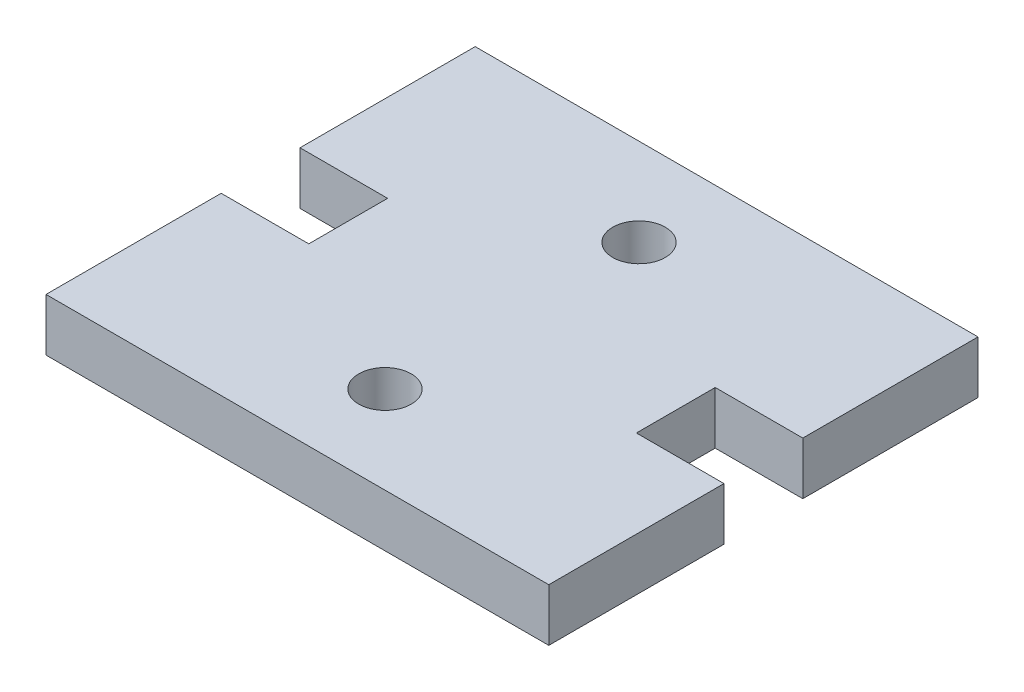
ISO-10303-21;
HEADER;
FILE_DESCRIPTION(('STEP AP214'),'2;1');
FILE_NAME('part.step','',(''),(''),'','','');
FILE_SCHEMA(('AUTOMOTIVE_DESIGN { 1 0 10303 214 1 1 1 1 }'));
ENDSEC;
DATA;
#1=APPLICATION_CONTEXT('core data for automotive mechanical design processes');
#2=APPLICATION_PROTOCOL_DEFINITION('international standard','automotive_design',2000,#1);
#3=PRODUCT_CONTEXT('',#1,'mechanical');
#4=PRODUCT('Part','Part','',(#3));
#5=PRODUCT_RELATED_PRODUCT_CATEGORY('part','',(#4));
#6=PRODUCT_DEFINITION_FORMATION('','',#4);
#7=PRODUCT_DEFINITION_CONTEXT('part definition',#1,'design');
#8=PRODUCT_DEFINITION('design','',#6,#7);
#9=PRODUCT_DEFINITION_SHAPE('','',#8);
#10=(LENGTH_UNIT() NAMED_UNIT(*) SI_UNIT(.MILLI.,.METRE.));
#11=(NAMED_UNIT(*) PLANE_ANGLE_UNIT() SI_UNIT($,.RADIAN.));
#12=(NAMED_UNIT(*) SI_UNIT($,.STERADIAN.) SOLID_ANGLE_UNIT());
#13=UNCERTAINTY_MEASURE_WITH_UNIT(LENGTH_MEASURE(1.E-05),#10,'distance_accuracy_value','');
#14=(GEOMETRIC_REPRESENTATION_CONTEXT(3) GLOBAL_UNCERTAINTY_ASSIGNED_CONTEXT((#13)) GLOBAL_UNIT_ASSIGNED_CONTEXT((#10,
#11,#12)) REPRESENTATION_CONTEXT('',''));
#15=CARTESIAN_POINT('',(0.,0.,0.));
#16=DIRECTION('',(0.,0.,1.));
#17=DIRECTION('',(1.,0.,0.));
#18=AXIS2_PLACEMENT_3D('',#15,#16,#17);
#19=CARTESIAN_POINT('',(0.,3.,0.));
#20=DIRECTION('',(0.,-1.,0.));
#21=DIRECTION('',(0.,0.,-1.));
#22=AXIS2_PLACEMENT_3D('',#19,#20,#21);
#23=PLANE('',#22);
#24=DIRECTION('',(1.,0.,0.));
#25=VECTOR('',#24,1.);
#26=CARTESIAN_POINT('',(-9.35000000000002,3.,-2.25000000000003));
#27=LINE('',#26,#25);
#28=CARTESIAN_POINT('',(-14.35,3.,-2.25000000000003));
#29=VERTEX_POINT('',#28);
#30=CARTESIAN_POINT('',(-9.35000000000002,3.,-2.25000000000003));
#31=VERTEX_POINT('',#30);
#32=EDGE_CURVE('E182',#29,#31,#27,.T.);
#33=ORIENTED_EDGE('',*,*,#32,.T.);
#34=DIRECTION('',(0.,0.,1.));
#35=VECTOR('',#34,1.);
#36=CARTESIAN_POINT('',(-9.35000000000002,3.,2.25));
#37=LINE('',#36,#35);
#38=CARTESIAN_POINT('',(-9.35000000000002,3.,2.25));
#39=VERTEX_POINT('',#38);
#40=EDGE_CURVE('E110',#31,#39,#37,.T.);
#41=ORIENTED_EDGE('',*,*,#40,.T.);
#42=DIRECTION('',(-1.,0.,0.));
#43=VECTOR('',#42,1.);
#44=CARTESIAN_POINT('',(-14.35,3.,2.25));
#45=LINE('',#44,#43);
#46=CARTESIAN_POINT('',(-14.35,3.,2.25));
#47=VERTEX_POINT('',#46);
#48=EDGE_CURVE('E209',#39,#47,#45,.T.);
#49=ORIENTED_EDGE('',*,*,#48,.T.);
#50=DIRECTION('',(0.,0.,1.));
#51=VECTOR('',#50,1.);
#52=CARTESIAN_POINT('',(-14.35,3.,12.25));
#53=LINE('',#52,#51);
#54=CARTESIAN_POINT('',(-14.35,3.,12.25));
#55=VERTEX_POINT('',#54);
#56=EDGE_CURVE('E228',#47,#55,#53,.T.);
#57=ORIENTED_EDGE('',*,*,#56,.T.);
#58=DIRECTION('',(1.,0.,0.));
#59=VECTOR('',#58,1.);
#60=CARTESIAN_POINT('',(14.35,3.,12.25));
#61=LINE('',#60,#59);
#62=CARTESIAN_POINT('',(14.35,3.,12.25));
#63=VERTEX_POINT('',#62);
#64=EDGE_CURVE('E225',#55,#63,#61,.T.);
#65=ORIENTED_EDGE('',*,*,#64,.T.);
#66=DIRECTION('',(0.,0.,-1.));
#67=VECTOR('',#66,1.);
#68=CARTESIAN_POINT('',(14.35,3.,2.25));
#69=LINE('',#68,#67);
#70=CARTESIAN_POINT('',(14.35,3.,2.25));
#71=VERTEX_POINT('',#70);
#72=EDGE_CURVE('E227',#63,#71,#69,.T.);
#73=ORIENTED_EDGE('',*,*,#72,.T.);
#74=DIRECTION('',(-1.,0.,0.));
#75=VECTOR('',#74,1.);
#76=CARTESIAN_POINT('',(9.34999999999997,3.,2.25));
#77=LINE('',#76,#75);
#78=CARTESIAN_POINT('',(9.34999999999997,3.,2.25));
#79=VERTEX_POINT('',#78);
#80=EDGE_CURVE('E230',#71,#79,#77,.T.);
#81=ORIENTED_EDGE('',*,*,#80,.T.);
#82=DIRECTION('',(0.,0.,-1.));
#83=VECTOR('',#82,1.);
#84=CARTESIAN_POINT('',(9.34999999999997,3.,-2.25000000000003));
#85=LINE('',#84,#83);
#86=CARTESIAN_POINT('',(9.34999999999997,3.,-2.25000000000003));
#87=VERTEX_POINT('',#86);
#88=EDGE_CURVE('E236',#79,#87,#85,.T.);
#89=ORIENTED_EDGE('',*,*,#88,.T.);
#90=DIRECTION('',(1.,0.,0.));
#91=VECTOR('',#90,1.);
#92=CARTESIAN_POINT('',(14.35,3.,-2.25000000000003));
#93=LINE('',#92,#91);
#94=CARTESIAN_POINT('',(14.35,3.,-2.25000000000003));
#95=VERTEX_POINT('',#94);
#96=EDGE_CURVE('E141',#87,#95,#93,.T.);
#97=ORIENTED_EDGE('',*,*,#96,.T.);
#98=DIRECTION('',(0.,0.,-1.));
#99=VECTOR('',#98,1.);
#100=CARTESIAN_POINT('',(14.35,3.,-12.25));
#101=LINE('',#100,#99);
#102=CARTESIAN_POINT('',(14.35,3.,-12.25));
#103=VERTEX_POINT('',#102);
#104=EDGE_CURVE('E135',#95,#103,#101,.T.);
#105=ORIENTED_EDGE('',*,*,#104,.T.);
#106=DIRECTION('',(-1.,0.,0.));
#107=VECTOR('',#106,1.);
#108=CARTESIAN_POINT('',(-14.35,3.,-12.25));
#109=LINE('',#108,#107);
#110=CARTESIAN_POINT('',(-14.35,3.,-12.25));
#111=VERTEX_POINT('',#110);
#112=EDGE_CURVE('E139',#103,#111,#109,.T.);
#113=ORIENTED_EDGE('',*,*,#112,.T.);
#114=DIRECTION('',(0.,0.,1.));
#115=VECTOR('',#114,1.);
#116=CARTESIAN_POINT('',(-14.35,3.,-2.25000000000003));
#117=LINE('',#116,#115);
#118=EDGE_CURVE('E55',#111,#29,#117,.T.);
#119=ORIENTED_EDGE('',*,*,#118,.T.);
#120=EDGE_LOOP('',(#33,#41,#49,#57,#65,#73,#81,#89,#97,#105,#113,#119));
#121=FACE_BOUND('',#120,.T.);
#122=CARTESIAN_POINT('',(0.,3.,-7.25000000000003));
#123=DIRECTION('',(0.,1.,0.));
#124=DIRECTION('',(0.,0.,1.));
#125=AXIS2_PLACEMENT_3D('',#122,#123,#124);
#126=CIRCLE('',#125,1.5);
#127=CARTESIAN_POINT('',(0.,3.,-5.75000000000003));
#128=VERTEX_POINT('',#127);
#129=EDGE_CURVE('E163',#128,#128,#126,.T.);
#130=ORIENTED_EDGE('',*,*,#129,.F.);
#131=EDGE_LOOP('',(#130));
#132=FACE_BOUND('',#131,.T.);
#133=CARTESIAN_POINT('',(0.,3.,7.25000000000001));
#134=DIRECTION('',(0.,1.,0.));
#135=DIRECTION('',(0.,0.,1.));
#136=AXIS2_PLACEMENT_3D('',#133,#134,#135);
#137=CIRCLE('',#136,1.5);
#138=CARTESIAN_POINT('',(0.,3.,8.75000000000001));
#139=VERTEX_POINT('',#138);
#140=EDGE_CURVE('E277',#139,#139,#137,.T.);
#141=ORIENTED_EDGE('',*,*,#140,.F.);
#142=EDGE_LOOP('',(#141));
#143=FACE_BOUND('',#142,.T.);
#144=ADVANCED_FACE('F38',(#121,#132,#143),#23,.F.);
#145=CARTESIAN_POINT('',(0.,0.,0.));
#146=DIRECTION('',(0.,-1.,0.));
#147=DIRECTION('',(0.,0.,-1.));
#148=AXIS2_PLACEMENT_3D('',#145,#146,#147);
#149=PLANE('',#148);
#150=CARTESIAN_POINT('',(0.,0.,-7.25000000000003));
#151=DIRECTION('',(0.,1.,0.));
#152=DIRECTION('',(0.,0.,1.));
#153=AXIS2_PLACEMENT_3D('',#150,#151,#152);
#154=CIRCLE('',#153,1.5);
#155=CARTESIAN_POINT('',(0.,0.,-5.75000000000003));
#156=VERTEX_POINT('',#155);
#157=EDGE_CURVE('E282',#156,#156,#154,.T.);
#158=ORIENTED_EDGE('',*,*,#157,.T.);
#159=EDGE_LOOP('',(#158));
#160=FACE_BOUND('',#159,.T.);
#161=DIRECTION('',(1.,0.,0.));
#162=VECTOR('',#161,1.);
#163=CARTESIAN_POINT('',(-9.35000000000002,0.,-2.25000000000003));
#164=LINE('',#163,#162);
#165=CARTESIAN_POINT('',(-14.35,0.,-2.25000000000003));
#166=VERTEX_POINT('',#165);
#167=CARTESIAN_POINT('',(-9.35000000000002,0.,-2.25000000000003));
#168=VERTEX_POINT('',#167);
#169=EDGE_CURVE('E159',#166,#168,#164,.T.);
#170=ORIENTED_EDGE('',*,*,#169,.F.);
#171=DIRECTION('',(0.,0.,1.));
#172=VECTOR('',#171,1.);
#173=CARTESIAN_POINT('',(-14.35,0.,-2.25000000000003));
#174=LINE('',#173,#172);
#175=CARTESIAN_POINT('',(-14.35,0.,-12.25));
#176=VERTEX_POINT('',#175);
#177=EDGE_CURVE('E102',#176,#166,#174,.T.);
#178=ORIENTED_EDGE('',*,*,#177,.F.);
#179=DIRECTION('',(-1.,0.,0.));
#180=VECTOR('',#179,1.);
#181=CARTESIAN_POINT('',(-14.35,0.,-12.25));
#182=LINE('',#181,#180);
#183=CARTESIAN_POINT('',(14.35,0.,-12.25));
#184=VERTEX_POINT('',#183);
#185=EDGE_CURVE('E96',#184,#176,#182,.T.);
#186=ORIENTED_EDGE('',*,*,#185,.F.);
#187=DIRECTION('',(0.,0.,-1.));
#188=VECTOR('',#187,1.);
#189=CARTESIAN_POINT('',(14.35,0.,-12.25));
#190=LINE('',#189,#188);
#191=CARTESIAN_POINT('',(14.35,0.,-2.25000000000003));
#192=VERTEX_POINT('',#191);
#193=EDGE_CURVE('E149',#192,#184,#190,.T.);
#194=ORIENTED_EDGE('',*,*,#193,.F.);
#195=DIRECTION('',(1.,0.,0.));
#196=VECTOR('',#195,1.);
#197=CARTESIAN_POINT('',(14.35,0.,-2.25000000000003));
#198=LINE('',#197,#196);
#199=CARTESIAN_POINT('',(9.34999999999997,0.,-2.25000000000003));
#200=VERTEX_POINT('',#199);
#201=EDGE_CURVE('E177',#200,#192,#198,.T.);
#202=ORIENTED_EDGE('',*,*,#201,.F.);
#203=DIRECTION('',(0.,0.,-1.));
#204=VECTOR('',#203,1.);
#205=CARTESIAN_POINT('',(9.34999999999997,0.,-2.25000000000003));
#206=LINE('',#205,#204);
#207=CARTESIAN_POINT('',(9.34999999999997,0.,2.25));
#208=VERTEX_POINT('',#207);
#209=EDGE_CURVE('E175',#208,#200,#206,.T.);
#210=ORIENTED_EDGE('',*,*,#209,.F.);
#211=DIRECTION('',(-1.,0.,0.));
#212=VECTOR('',#211,1.);
#213=CARTESIAN_POINT('',(9.34999999999997,0.,2.25));
#214=LINE('',#213,#212);
#215=CARTESIAN_POINT('',(14.35,0.,2.25));
#216=VERTEX_POINT('',#215);
#217=EDGE_CURVE('E173',#216,#208,#214,.T.);
#218=ORIENTED_EDGE('',*,*,#217,.F.);
#219=DIRECTION('',(0.,0.,-1.));
#220=VECTOR('',#219,1.);
#221=CARTESIAN_POINT('',(14.35,0.,2.25));
#222=LINE('',#221,#220);
#223=CARTESIAN_POINT('',(14.35,0.,12.25));
#224=VERTEX_POINT('',#223);
#225=EDGE_CURVE('E171',#224,#216,#222,.T.);
#226=ORIENTED_EDGE('',*,*,#225,.F.);
#227=DIRECTION('',(1.,0.,0.));
#228=VECTOR('',#227,1.);
#229=CARTESIAN_POINT('',(14.35,0.,12.25));
#230=LINE('',#229,#228);
#231=CARTESIAN_POINT('',(-14.35,0.,12.25));
#232=VERTEX_POINT('',#231);
#233=EDGE_CURVE('E169',#232,#224,#230,.T.);
#234=ORIENTED_EDGE('',*,*,#233,.F.);
#235=DIRECTION('',(0.,0.,1.));
#236=VECTOR('',#235,1.);
#237=CARTESIAN_POINT('',(-14.35,0.,12.25));
#238=LINE('',#237,#236);
#239=CARTESIAN_POINT('',(-14.35,0.,2.25));
#240=VERTEX_POINT('',#239);
#241=EDGE_CURVE('E167',#240,#232,#238,.T.);
#242=ORIENTED_EDGE('',*,*,#241,.F.);
#243=DIRECTION('',(-1.,0.,0.));
#244=VECTOR('',#243,1.);
#245=CARTESIAN_POINT('',(-14.35,0.,2.25));
#246=LINE('',#245,#244);
#247=CARTESIAN_POINT('',(-9.35000000000002,0.,2.25));
#248=VERTEX_POINT('',#247);
#249=EDGE_CURVE('E165',#248,#240,#246,.T.);
#250=ORIENTED_EDGE('',*,*,#249,.F.);
#251=DIRECTION('',(0.,0.,1.));
#252=VECTOR('',#251,1.);
#253=CARTESIAN_POINT('',(-9.35000000000002,0.,2.25));
#254=LINE('',#253,#252);
#255=EDGE_CURVE('E162',#168,#248,#254,.T.);
#256=ORIENTED_EDGE('',*,*,#255,.F.);
#257=EDGE_LOOP('',(#170,#178,#186,#194,#202,#210,#218,#226,#234,#242,#250,#256));
#258=FACE_BOUND('',#257,.T.);
#259=CARTESIAN_POINT('',(0.,0.,7.25000000000001));
#260=DIRECTION('',(0.,1.,0.));
#261=DIRECTION('',(0.,0.,1.));
#262=AXIS2_PLACEMENT_3D('',#259,#260,#261);
#263=CIRCLE('',#262,1.5);
#264=CARTESIAN_POINT('',(0.,0.,8.75000000000001));
#265=VERTEX_POINT('',#264);
#266=EDGE_CURVE('E280',#265,#265,#263,.T.);
#267=ORIENTED_EDGE('',*,*,#266,.T.);
#268=EDGE_LOOP('',(#267));
#269=FACE_BOUND('',#268,.T.);
#270=ADVANCED_FACE('F213',(#160,#258,#269),#149,.T.);
#271=CARTESIAN_POINT('',(-9.35000000000002,3.,-2.25000000000003));
#272=DIRECTION('',(0.,0.,-1.));
#273=DIRECTION('',(-1.,0.,0.));
#274=AXIS2_PLACEMENT_3D('',#271,#272,#273);
#275=PLANE('',#274);
#276=ORIENTED_EDGE('',*,*,#169,.T.);
#277=DIRECTION('',(0.,-1.,0.));
#278=VECTOR('',#277,1.);
#279=CARTESIAN_POINT('',(-9.35000000000002,3.,-2.25000000000003));
#280=LINE('',#279,#278);
#281=EDGE_CURVE('E11',#31,#168,#280,.T.);
#282=ORIENTED_EDGE('',*,*,#281,.F.);
#283=ORIENTED_EDGE('',*,*,#32,.F.);
#284=DIRECTION('',(0.,-1.,0.));
#285=VECTOR('',#284,1.);
#286=CARTESIAN_POINT('',(-14.35,3.,-2.25000000000003));
#287=LINE('',#286,#285);
#288=EDGE_CURVE('E155',#29,#166,#287,.T.);
#289=ORIENTED_EDGE('',*,*,#288,.T.);
#290=EDGE_LOOP('',(#276,#282,#283,#289));
#291=FACE_BOUND('',#290,.T.);
#292=ADVANCED_FACE('F40',(#291),#275,.F.);
#293=CARTESIAN_POINT('',(-9.35000000000002,3.,2.25));
#294=DIRECTION('',(1.,0.,0.));
#295=DIRECTION('',(0.,0.,-1.));
#296=AXIS2_PLACEMENT_3D('',#293,#294,#295);
#297=PLANE('',#296);
#298=ORIENTED_EDGE('',*,*,#255,.T.);
#299=DIRECTION('',(0.,-1.,0.));
#300=VECTOR('',#299,1.);
#301=CARTESIAN_POINT('',(-9.35000000000002,3.,2.25));
#302=LINE('',#301,#300);
#303=EDGE_CURVE('E47',#39,#248,#302,.T.);
#304=ORIENTED_EDGE('',*,*,#303,.F.);
#305=ORIENTED_EDGE('',*,*,#40,.F.);
#306=ORIENTED_EDGE('',*,*,#281,.T.);
#307=EDGE_LOOP('',(#298,#304,#305,#306));
#308=FACE_BOUND('',#307,.T.);
#309=ADVANCED_FACE('F387',(#308),#297,.F.);
#310=CARTESIAN_POINT('',(-14.35,3.,2.25));
#311=DIRECTION('',(0.,0.,1.));
#312=DIRECTION('',(1.,0.,0.));
#313=AXIS2_PLACEMENT_3D('',#310,#311,#312);
#314=PLANE('',#313);
#315=ORIENTED_EDGE('',*,*,#249,.T.);
#316=DIRECTION('',(0.,-1.,0.));
#317=VECTOR('',#316,1.);
#318=CARTESIAN_POINT('',(-14.35,3.,2.25));
#319=LINE('',#318,#317);
#320=EDGE_CURVE('E201',#47,#240,#319,.T.);
#321=ORIENTED_EDGE('',*,*,#320,.F.);
#322=ORIENTED_EDGE('',*,*,#48,.F.);
#323=ORIENTED_EDGE('',*,*,#303,.T.);
#324=EDGE_LOOP('',(#315,#321,#322,#323));
#325=FACE_BOUND('',#324,.T.);
#326=ADVANCED_FACE('F207',(#325),#314,.F.);
#327=CARTESIAN_POINT('',(-14.35,3.,12.25));
#328=DIRECTION('',(1.,0.,0.));
#329=DIRECTION('',(0.,0.,-1.));
#330=AXIS2_PLACEMENT_3D('',#327,#328,#329);
#331=PLANE('',#330);
#332=ORIENTED_EDGE('',*,*,#241,.T.);
#333=DIRECTION('',(0.,-1.,0.));
#334=VECTOR('',#333,1.);
#335=CARTESIAN_POINT('',(-14.35,3.,12.25));
#336=LINE('',#335,#334);
#337=EDGE_CURVE('E198',#55,#232,#336,.T.);
#338=ORIENTED_EDGE('',*,*,#337,.F.);
#339=ORIENTED_EDGE('',*,*,#56,.F.);
#340=ORIENTED_EDGE('',*,*,#320,.T.);
#341=EDGE_LOOP('',(#332,#338,#339,#340));
#342=FACE_BOUND('',#341,.T.);
#343=ADVANCED_FACE('F219',(#342),#331,.F.);
#344=CARTESIAN_POINT('',(14.35,3.,12.25));
#345=DIRECTION('',(0.,0.,-1.));
#346=DIRECTION('',(-1.,0.,0.));
#347=AXIS2_PLACEMENT_3D('',#344,#345,#346);
#348=PLANE('',#347);
#349=ORIENTED_EDGE('',*,*,#233,.T.);
#350=DIRECTION('',(0.,-1.,0.));
#351=VECTOR('',#350,1.);
#352=CARTESIAN_POINT('',(14.35,3.,12.25));
#353=LINE('',#352,#351);
#354=EDGE_CURVE('E195',#63,#224,#353,.T.);
#355=ORIENTED_EDGE('',*,*,#354,.F.);
#356=ORIENTED_EDGE('',*,*,#64,.F.);
#357=ORIENTED_EDGE('',*,*,#337,.T.);
#358=EDGE_LOOP('',(#349,#355,#356,#357));
#359=FACE_BOUND('',#358,.T.);
#360=ADVANCED_FACE('F223',(#359),#348,.F.);
#361=CARTESIAN_POINT('',(14.35,3.,2.25));
#362=DIRECTION('',(-1.,0.,0.));
#363=DIRECTION('',(0.,0.,1.));
#364=AXIS2_PLACEMENT_3D('',#361,#362,#363);
#365=PLANE('',#364);
#366=ORIENTED_EDGE('',*,*,#225,.T.);
#367=DIRECTION('',(0.,-1.,0.));
#368=VECTOR('',#367,1.);
#369=CARTESIAN_POINT('',(14.35,3.,2.25));
#370=LINE('',#369,#368);
#371=EDGE_CURVE('E192',#71,#216,#370,.T.);
#372=ORIENTED_EDGE('',*,*,#371,.F.);
#373=ORIENTED_EDGE('',*,*,#72,.F.);
#374=ORIENTED_EDGE('',*,*,#354,.T.);
#375=EDGE_LOOP('',(#366,#372,#373,#374));
#376=FACE_BOUND('',#375,.T.);
#377=ADVANCED_FACE('F348',(#376),#365,.F.);
#378=CARTESIAN_POINT('',(9.34999999999997,3.,2.25));
#379=DIRECTION('',(0.,0.,1.));
#380=DIRECTION('',(1.,0.,0.));
#381=AXIS2_PLACEMENT_3D('',#378,#379,#380);
#382=PLANE('',#381);
#383=ORIENTED_EDGE('',*,*,#217,.T.);
#384=DIRECTION('',(0.,-1.,0.));
#385=VECTOR('',#384,1.);
#386=CARTESIAN_POINT('',(9.34999999999997,3.,2.25));
#387=LINE('',#386,#385);
#388=EDGE_CURVE('E189',#79,#208,#387,.T.);
#389=ORIENTED_EDGE('',*,*,#388,.F.);
#390=ORIENTED_EDGE('',*,*,#80,.F.);
#391=ORIENTED_EDGE('',*,*,#371,.T.);
#392=EDGE_LOOP('',(#383,#389,#390,#391));
#393=FACE_BOUND('',#392,.T.);
#394=ADVANCED_FACE('F338',(#393),#382,.F.);
#395=CARTESIAN_POINT('',(9.34999999999997,3.,-2.25000000000003));
#396=DIRECTION('',(-1.,0.,0.));
#397=DIRECTION('',(0.,0.,1.));
#398=AXIS2_PLACEMENT_3D('',#395,#396,#397);
#399=PLANE('',#398);
#400=ORIENTED_EDGE('',*,*,#209,.T.);
#401=DIRECTION('',(0.,-1.,0.));
#402=VECTOR('',#401,1.);
#403=CARTESIAN_POINT('',(9.34999999999997,3.,-2.25000000000003));
#404=LINE('',#403,#402);
#405=EDGE_CURVE('E186',#87,#200,#404,.T.);
#406=ORIENTED_EDGE('',*,*,#405,.F.);
#407=ORIENTED_EDGE('',*,*,#88,.F.);
#408=ORIENTED_EDGE('',*,*,#388,.T.);
#409=EDGE_LOOP('',(#400,#406,#407,#408));
#410=FACE_BOUND('',#409,.T.);
#411=ADVANCED_FACE('F242',(#410),#399,.F.);
#412=CARTESIAN_POINT('',(14.35,3.,-2.25000000000003));
#413=DIRECTION('',(0.,0.,-1.));
#414=DIRECTION('',(-1.,0.,0.));
#415=AXIS2_PLACEMENT_3D('',#412,#413,#414);
#416=PLANE('',#415);
#417=ORIENTED_EDGE('',*,*,#201,.T.);
#418=DIRECTION('',(0.,-1.,0.));
#419=VECTOR('',#418,1.);
#420=CARTESIAN_POINT('',(14.35,3.,-2.25000000000003));
#421=LINE('',#420,#419);
#422=EDGE_CURVE('E150',#95,#192,#421,.T.);
#423=ORIENTED_EDGE('',*,*,#422,.F.);
#424=ORIENTED_EDGE('',*,*,#96,.F.);
#425=ORIENTED_EDGE('',*,*,#405,.T.);
#426=EDGE_LOOP('',(#417,#423,#424,#425));
#427=FACE_BOUND('',#426,.T.);
#428=ADVANCED_FACE('F246',(#427),#416,.F.);
#429=CARTESIAN_POINT('',(14.35,3.,-12.25));
#430=DIRECTION('',(-1.,0.,0.));
#431=DIRECTION('',(0.,0.,1.));
#432=AXIS2_PLACEMENT_3D('',#429,#430,#431);
#433=PLANE('',#432);
#434=ORIENTED_EDGE('',*,*,#193,.T.);
#435=DIRECTION('',(0.,-1.,0.));
#436=VECTOR('',#435,1.);
#437=CARTESIAN_POINT('',(14.35,3.,-12.25));
#438=LINE('',#437,#436);
#439=EDGE_CURVE('E146',#103,#184,#438,.T.);
#440=ORIENTED_EDGE('',*,*,#439,.F.);
#441=ORIENTED_EDGE('',*,*,#104,.F.);
#442=ORIENTED_EDGE('',*,*,#422,.T.);
#443=EDGE_LOOP('',(#434,#440,#441,#442));
#444=FACE_BOUND('',#443,.T.);
#445=ADVANCED_FACE('F147',(#444),#433,.F.);
#446=CARTESIAN_POINT('',(-14.35,3.,-12.25));
#447=DIRECTION('',(0.,0.,1.));
#448=DIRECTION('',(1.,0.,0.));
#449=AXIS2_PLACEMENT_3D('',#446,#447,#448);
#450=PLANE('',#449);
#451=ORIENTED_EDGE('',*,*,#185,.T.);
#452=DIRECTION('',(0.,-1.,0.));
#453=VECTOR('',#452,1.);
#454=CARTESIAN_POINT('',(-14.35,3.,-12.25));
#455=LINE('',#454,#453);
#456=EDGE_CURVE('E151',#111,#176,#455,.T.);
#457=ORIENTED_EDGE('',*,*,#456,.F.);
#458=ORIENTED_EDGE('',*,*,#112,.F.);
#459=ORIENTED_EDGE('',*,*,#439,.T.);
#460=EDGE_LOOP('',(#451,#457,#458,#459));
#461=FACE_BOUND('',#460,.T.);
#462=ADVANCED_FACE('F153',(#461),#450,.F.);
#463=CARTESIAN_POINT('',(-14.35,3.,-2.25000000000003));
#464=DIRECTION('',(1.,0.,0.));
#465=DIRECTION('',(0.,0.,-1.));
#466=AXIS2_PLACEMENT_3D('',#463,#464,#465);
#467=PLANE('',#466);
#468=ORIENTED_EDGE('',*,*,#177,.T.);
#469=ORIENTED_EDGE('',*,*,#288,.F.);
#470=ORIENTED_EDGE('',*,*,#118,.F.);
#471=ORIENTED_EDGE('',*,*,#456,.T.);
#472=EDGE_LOOP('',(#468,#469,#470,#471));
#473=FACE_BOUND('',#472,.T.);
#474=ADVANCED_FACE('F250',(#473),#467,.F.);
#475=CARTESIAN_POINT('',(0.,3.,-7.25000000000003));
#476=DIRECTION('',(0.,-1.,0.));
#477=DIRECTION('',(0.,0.,-1.));
#478=AXIS2_PLACEMENT_3D('',#475,#476,#477);
#479=CYLINDRICAL_SURFACE('',#478,1.5);
#480=ORIENTED_EDGE('',*,*,#129,.T.);
#481=EDGE_LOOP('',(#480));
#482=FACE_BOUND('',#481,.T.);
#483=ORIENTED_EDGE('',*,*,#157,.F.);
#484=EDGE_LOOP('',(#483));
#485=FACE_BOUND('',#484,.T.);
#486=ADVANCED_FACE('F252',(#482,#485),#479,.F.);
#487=CARTESIAN_POINT('',(0.,3.,7.25000000000001));
#488=DIRECTION('',(0.,-1.,0.));
#489=DIRECTION('',(0.,0.,-1.));
#490=AXIS2_PLACEMENT_3D('',#487,#488,#489);
#491=CYLINDRICAL_SURFACE('',#490,1.5);
#492=ORIENTED_EDGE('',*,*,#140,.T.);
#493=EDGE_LOOP('',(#492));
#494=FACE_BOUND('',#493,.T.);
#495=ORIENTED_EDGE('',*,*,#266,.F.);
#496=EDGE_LOOP('',(#495));
#497=FACE_BOUND('',#496,.T.);
#498=ADVANCED_FACE('F258',(#494,#497),#491,.F.);
#499=CLOSED_SHELL('',(#144,#270,#292,#309,#326,#343,#360,#377,#394,#411,#428,#445,#462,#474,
#486,#498));
#500=MANIFOLD_SOLID_BREP('B2',#499);
#501=ADVANCED_BREP_SHAPE_REPRESENTATION('',(#18,#500),#14);
#502=SHAPE_DEFINITION_REPRESENTATION(#9,#501);
ENDSEC;
END-ISO-10303-21;
